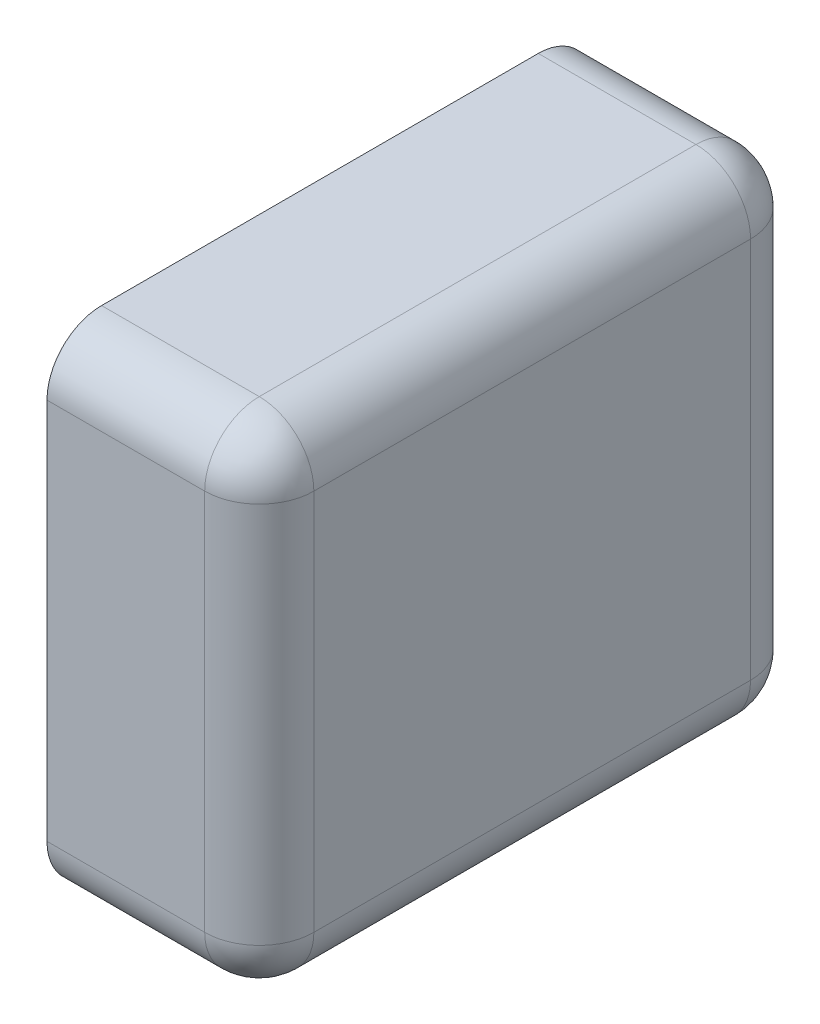
ISO-10303-21;
HEADER;
FILE_DESCRIPTION(('STEP AP214'),'2;1');
FILE_NAME('part.step','',(''),(''),'','','');
FILE_SCHEMA(('AUTOMOTIVE_DESIGN { 1 0 10303 214 1 1 1 1 }'));
ENDSEC;
DATA;
#1=APPLICATION_CONTEXT('core data for automotive mechanical design processes');
#2=APPLICATION_PROTOCOL_DEFINITION('international standard','automotive_design',2000,#1);
#3=PRODUCT_CONTEXT('',#1,'mechanical');
#4=PRODUCT('Part','Part','',(#3));
#5=PRODUCT_RELATED_PRODUCT_CATEGORY('part','',(#4));
#6=PRODUCT_DEFINITION_FORMATION('','',#4);
#7=PRODUCT_DEFINITION_CONTEXT('part definition',#1,'design');
#8=PRODUCT_DEFINITION('design','',#6,#7);
#9=PRODUCT_DEFINITION_SHAPE('','',#8);
#10=(LENGTH_UNIT() NAMED_UNIT(*) SI_UNIT(.MILLI.,.METRE.));
#11=(NAMED_UNIT(*) PLANE_ANGLE_UNIT() SI_UNIT($,.RADIAN.));
#12=(NAMED_UNIT(*) SI_UNIT($,.STERADIAN.) SOLID_ANGLE_UNIT());
#13=UNCERTAINTY_MEASURE_WITH_UNIT(LENGTH_MEASURE(1.E-05),#10,'distance_accuracy_value','');
#14=(GEOMETRIC_REPRESENTATION_CONTEXT(3) GLOBAL_UNCERTAINTY_ASSIGNED_CONTEXT((#13)) GLOBAL_UNIT_ASSIGNED_CONTEXT((#10,
#11,#12)) REPRESENTATION_CONTEXT('',''));
#15=CARTESIAN_POINT('',(0.,0.,0.));
#16=DIRECTION('',(0.,0.,1.));
#17=DIRECTION('',(1.,0.,0.));
#18=AXIS2_PLACEMENT_3D('',#15,#16,#17);
#19=CARTESIAN_POINT('',(0.45,-0.405,0.));
#20=DIRECTION('',(1.,0.,0.));
#21=DIRECTION('',(0.,0.,1.));
#22=AXIS2_PLACEMENT_3D('',#19,#20,#21);
#23=PLANE('',#22);
#24=CARTESIAN_POINT('',(0.45,-0.315,0.81));
#25=DIRECTION('',(-1.,0.,0.));
#26=DIRECTION('',(0.,0.,1.));
#27=AXIS2_PLACEMENT_3D('',#24,#25,#26);
#28=CIRCLE('',#27,0.09);
#29=CARTESIAN_POINT('',(0.45,-0.405,0.81));
#30=VERTEX_POINT('',#29);
#31=CARTESIAN_POINT('',(0.45,-0.315,0.9));
#32=VERTEX_POINT('',#31);
#33=EDGE_CURVE('E11',#30,#32,#28,.T.);
#34=ORIENTED_EDGE('',*,*,#33,.T.);
#35=DIRECTION('',(0.,1.,0.));
#36=VECTOR('',#35,1.);
#37=CARTESIAN_POINT('',(0.45,-0.405,0.9));
#38=LINE('',#37,#36);
#39=CARTESIAN_POINT('',(0.45,0.315,0.9));
#40=VERTEX_POINT('',#39);
#41=EDGE_CURVE('E24',#32,#40,#38,.T.);
#42=ORIENTED_EDGE('',*,*,#41,.T.);
#43=CARTESIAN_POINT('',(0.45,0.315,0.81));
#44=DIRECTION('',(1.,0.,0.));
#45=DIRECTION('',(0.,0.,1.));
#46=AXIS2_PLACEMENT_3D('',#43,#44,#45);
#47=CIRCLE('',#46,0.09);
#48=CARTESIAN_POINT('',(0.45,0.405,0.81));
#49=VERTEX_POINT('',#48);
#50=EDGE_CURVE('E195',#49,#40,#47,.T.);
#51=ORIENTED_EDGE('',*,*,#50,.F.);
#52=DIRECTION('',(0.,0.,1.));
#53=VECTOR('',#52,1.);
#54=CARTESIAN_POINT('',(0.45,0.405,0.));
#55=LINE('',#54,#53);
#56=CARTESIAN_POINT('',(0.45,0.405,0.09));
#57=VERTEX_POINT('',#56);
#58=EDGE_CURVE('E193',#57,#49,#55,.T.);
#59=ORIENTED_EDGE('',*,*,#58,.F.);
#60=CARTESIAN_POINT('',(0.45,0.315,0.09));
#61=DIRECTION('',(-1.,0.,0.));
#62=DIRECTION('',(0.,0.,1.));
#63=AXIS2_PLACEMENT_3D('',#60,#61,#62);
#64=CIRCLE('',#63,0.09);
#65=CARTESIAN_POINT('',(0.45,0.315,0.));
#66=VERTEX_POINT('',#65);
#67=EDGE_CURVE('E190',#57,#66,#64,.T.);
#68=ORIENTED_EDGE('',*,*,#67,.T.);
#69=DIRECTION('',(0.,1.,0.));
#70=VECTOR('',#69,1.);
#71=CARTESIAN_POINT('',(0.45,-0.405,0.));
#72=LINE('',#71,#70);
#73=CARTESIAN_POINT('',(0.45,-0.315,0.));
#74=VERTEX_POINT('',#73);
#75=EDGE_CURVE('E188',#74,#66,#72,.T.);
#76=ORIENTED_EDGE('',*,*,#75,.F.);
#77=CARTESIAN_POINT('',(0.45,-0.315,0.09));
#78=DIRECTION('',(1.,0.,0.));
#79=DIRECTION('',(0.,0.,1.));
#80=AXIS2_PLACEMENT_3D('',#77,#78,#79);
#81=CIRCLE('',#80,0.09);
#82=CARTESIAN_POINT('',(0.45,-0.405,0.09));
#83=VERTEX_POINT('',#82);
#84=EDGE_CURVE('E186',#83,#74,#81,.T.);
#85=ORIENTED_EDGE('',*,*,#84,.F.);
#86=DIRECTION('',(0.,0.,1.));
#87=VECTOR('',#86,1.);
#88=CARTESIAN_POINT('',(0.45,-0.405,0.));
#89=LINE('',#88,#87);
#90=EDGE_CURVE('E36',#83,#30,#89,.T.);
#91=ORIENTED_EDGE('',*,*,#90,.T.);
#92=EDGE_LOOP('',(#34,#42,#51,#59,#68,#76,#85,#91));
#93=FACE_BOUND('',#92,.T.);
#94=ADVANCED_FACE('F17',(#93),#23,.F.);
#95=CARTESIAN_POINT('',(0.45,-0.405,0.));
#96=DIRECTION('',(0.,1.,0.));
#97=DIRECTION('',(0.,0.,1.));
#98=AXIS2_PLACEMENT_3D('',#95,#96,#97);
#99=PLANE('',#98);
#100=DIRECTION('',(1.,0.,0.));
#101=VECTOR('',#100,1.);
#102=CARTESIAN_POINT('',(0.45,-0.405,0.09));
#103=LINE('',#102,#101);
#104=CARTESIAN_POINT('',(0.71,-0.405,0.09));
#105=VERTEX_POINT('',#104);
#106=EDGE_CURVE('E182',#83,#105,#103,.T.);
#107=ORIENTED_EDGE('',*,*,#106,.T.);
#108=DIRECTION('',(0.,0.,1.));
#109=VECTOR('',#108,1.);
#110=CARTESIAN_POINT('',(0.71,-0.405,0.));
#111=LINE('',#110,#109);
#112=CARTESIAN_POINT('',(0.71,-0.405,0.81));
#113=VERTEX_POINT('',#112);
#114=EDGE_CURVE('E179',#105,#113,#111,.T.);
#115=ORIENTED_EDGE('',*,*,#114,.T.);
#116=DIRECTION('',(1.,0.,0.));
#117=VECTOR('',#116,1.);
#118=CARTESIAN_POINT('',(0.45,-0.405,0.81));
#119=LINE('',#118,#117);
#120=EDGE_CURVE('E177',#30,#113,#119,.T.);
#121=ORIENTED_EDGE('',*,*,#120,.F.);
#122=ORIENTED_EDGE('',*,*,#90,.F.);
#123=EDGE_LOOP('',(#107,#115,#121,#122));
#124=FACE_BOUND('',#123,.T.);
#125=ADVANCED_FACE('F227',(#124),#99,.F.);
#126=CARTESIAN_POINT('',(0.45,-0.315,0.09));
#127=DIRECTION('',(1.,0.,0.));
#128=DIRECTION('',(0.,-1.,0.));
#129=AXIS2_PLACEMENT_3D('',#126,#127,#128);
#130=CYLINDRICAL_SURFACE('',#129,0.09);
#131=ORIENTED_EDGE('',*,*,#84,.T.);
#132=DIRECTION('',(1.,0.,0.));
#133=VECTOR('',#132,1.);
#134=CARTESIAN_POINT('',(0.45,-0.315,0.));
#135=LINE('',#134,#133);
#136=CARTESIAN_POINT('',(0.71,-0.315,0.));
#137=VERTEX_POINT('',#136);
#138=EDGE_CURVE('E175',#74,#137,#135,.T.);
#139=ORIENTED_EDGE('',*,*,#138,.T.);
#140=CARTESIAN_POINT('',(0.71,-0.315,0.09));
#141=DIRECTION('',(-1.,0.,0.));
#142=DIRECTION('',(0.,-1.,0.));
#143=AXIS2_PLACEMENT_3D('',#140,#141,#142);
#144=CIRCLE('',#143,0.09);
#145=EDGE_CURVE('E172',#137,#105,#144,.T.);
#146=ORIENTED_EDGE('',*,*,#145,.T.);
#147=ORIENTED_EDGE('',*,*,#106,.F.);
#148=EDGE_LOOP('',(#131,#139,#146,#147));
#149=FACE_BOUND('',#148,.T.);
#150=ADVANCED_FACE('F219',(#149),#130,.T.);
#151=CARTESIAN_POINT('',(0.45,-0.315,0.81));
#152=DIRECTION('',(1.,0.,0.));
#153=DIRECTION('',(0.,-1.,0.));
#154=AXIS2_PLACEMENT_3D('',#151,#152,#153);
#155=CYLINDRICAL_SURFACE('',#154,0.09);
#156=ORIENTED_EDGE('',*,*,#120,.T.);
#157=CARTESIAN_POINT('',(0.71,-0.315,0.81));
#158=DIRECTION('',(1.,0.,0.));
#159=DIRECTION('',(0.,-1.,0.));
#160=AXIS2_PLACEMENT_3D('',#157,#158,#159);
#161=CIRCLE('',#160,0.09);
#162=CARTESIAN_POINT('',(0.71,-0.315,0.9));
#163=VERTEX_POINT('',#162);
#164=EDGE_CURVE('E169',#163,#113,#161,.T.);
#165=ORIENTED_EDGE('',*,*,#164,.F.);
#166=DIRECTION('',(1.,0.,0.));
#167=VECTOR('',#166,1.);
#168=CARTESIAN_POINT('',(0.45,-0.315,0.9));
#169=LINE('',#168,#167);
#170=EDGE_CURVE('E167',#32,#163,#169,.T.);
#171=ORIENTED_EDGE('',*,*,#170,.F.);
#172=ORIENTED_EDGE('',*,*,#33,.F.);
#173=EDGE_LOOP('',(#156,#165,#171,#172));
#174=FACE_BOUND('',#173,.T.);
#175=ADVANCED_FACE('F229',(#174),#155,.T.);
#176=CARTESIAN_POINT('',(0.45,-0.405,0.));
#177=DIRECTION('',(0.,0.,1.));
#178=DIRECTION('',(1.,0.,0.));
#179=AXIS2_PLACEMENT_3D('',#176,#177,#178);
#180=PLANE('',#179);
#181=DIRECTION('',(1.,0.,0.));
#182=VECTOR('',#181,1.);
#183=CARTESIAN_POINT('',(0.45,0.315,0.));
#184=LINE('',#183,#182);
#185=CARTESIAN_POINT('',(0.71,0.315,0.));
#186=VERTEX_POINT('',#185);
#187=EDGE_CURVE('E164',#66,#186,#184,.T.);
#188=ORIENTED_EDGE('',*,*,#187,.T.);
#189=DIRECTION('',(0.,1.,0.));
#190=VECTOR('',#189,1.);
#191=CARTESIAN_POINT('',(0.71,-0.405,0.));
#192=LINE('',#191,#190);
#193=EDGE_CURVE('E162',#137,#186,#192,.T.);
#194=ORIENTED_EDGE('',*,*,#193,.F.);
#195=ORIENTED_EDGE('',*,*,#138,.F.);
#196=ORIENTED_EDGE('',*,*,#75,.T.);
#197=EDGE_LOOP('',(#188,#194,#195,#196));
#198=FACE_BOUND('',#197,.T.);
#199=ADVANCED_FACE('F215',(#198),#180,.F.);
#200=CARTESIAN_POINT('',(0.45,-0.405,0.9));
#201=DIRECTION('',(0.,0.,1.));
#202=DIRECTION('',(1.,0.,0.));
#203=AXIS2_PLACEMENT_3D('',#200,#201,#202);
#204=PLANE('',#203);
#205=ORIENTED_EDGE('',*,*,#41,.F.);
#206=ORIENTED_EDGE('',*,*,#170,.T.);
#207=DIRECTION('',(0.,1.,0.));
#208=VECTOR('',#207,1.);
#209=CARTESIAN_POINT('',(0.71,-0.405,0.9));
#210=LINE('',#209,#208);
#211=CARTESIAN_POINT('',(0.71,0.315,0.9));
#212=VERTEX_POINT('',#211);
#213=EDGE_CURVE('E160',#163,#212,#210,.T.);
#214=ORIENTED_EDGE('',*,*,#213,.T.);
#215=DIRECTION('',(1.,0.,0.));
#216=VECTOR('',#215,1.);
#217=CARTESIAN_POINT('',(0.45,0.315,0.9));
#218=LINE('',#217,#216);
#219=EDGE_CURVE('E157',#40,#212,#218,.T.);
#220=ORIENTED_EDGE('',*,*,#219,.F.);
#221=EDGE_LOOP('',(#205,#206,#214,#220));
#222=FACE_BOUND('',#221,.T.);
#223=ADVANCED_FACE('F200',(#222),#204,.T.);
#224=CARTESIAN_POINT('',(0.45,0.315,0.09));
#225=DIRECTION('',(1.,0.,0.));
#226=DIRECTION('',(0.,1.,0.));
#227=AXIS2_PLACEMENT_3D('',#224,#225,#226);
#228=CYLINDRICAL_SURFACE('',#227,0.09);
#229=DIRECTION('',(1.,0.,0.));
#230=VECTOR('',#229,1.);
#231=CARTESIAN_POINT('',(0.45,0.405,0.09));
#232=LINE('',#231,#230);
#233=CARTESIAN_POINT('',(0.71,0.405,0.09));
#234=VERTEX_POINT('',#233);
#235=EDGE_CURVE('E155',#57,#234,#232,.T.);
#236=ORIENTED_EDGE('',*,*,#235,.T.);
#237=CARTESIAN_POINT('',(0.71,0.315,0.09));
#238=DIRECTION('',(1.,0.,0.));
#239=DIRECTION('',(0.,1.,0.));
#240=AXIS2_PLACEMENT_3D('',#237,#238,#239);
#241=CIRCLE('',#240,0.09);
#242=EDGE_CURVE('E152',#186,#234,#241,.T.);
#243=ORIENTED_EDGE('',*,*,#242,.F.);
#244=ORIENTED_EDGE('',*,*,#187,.F.);
#245=ORIENTED_EDGE('',*,*,#67,.F.);
#246=EDGE_LOOP('',(#236,#243,#244,#245));
#247=FACE_BOUND('',#246,.T.);
#248=ADVANCED_FACE('F211',(#247),#228,.T.);
#249=CARTESIAN_POINT('',(0.45,0.315,0.81));
#250=DIRECTION('',(1.,0.,0.));
#251=DIRECTION('',(0.,1.,0.));
#252=AXIS2_PLACEMENT_3D('',#249,#250,#251);
#253=CYLINDRICAL_SURFACE('',#252,0.09);
#254=ORIENTED_EDGE('',*,*,#50,.T.);
#255=ORIENTED_EDGE('',*,*,#219,.T.);
#256=CARTESIAN_POINT('',(0.71,0.315,0.81));
#257=DIRECTION('',(1.,0.,0.));
#258=DIRECTION('',(0.,0.,1.));
#259=AXIS2_PLACEMENT_3D('',#256,#257,#258);
#260=CIRCLE('',#259,0.09);
#261=CARTESIAN_POINT('',(0.71,0.405,0.81));
#262=VERTEX_POINT('',#261);
#263=EDGE_CURVE('E112',#262,#212,#260,.T.);
#264=ORIENTED_EDGE('',*,*,#263,.F.);
#265=DIRECTION('',(1.,0.,0.));
#266=VECTOR('',#265,1.);
#267=CARTESIAN_POINT('',(0.45,0.405,0.81));
#268=LINE('',#267,#266);
#269=EDGE_CURVE('E148',#49,#262,#268,.T.);
#270=ORIENTED_EDGE('',*,*,#269,.F.);
#271=EDGE_LOOP('',(#254,#255,#264,#270));
#272=FACE_BOUND('',#271,.T.);
#273=ADVANCED_FACE('F202',(#272),#253,.T.);
#274=CARTESIAN_POINT('',(0.45,0.405,0.));
#275=DIRECTION('',(0.,1.,0.));
#276=DIRECTION('',(0.,0.,1.));
#277=AXIS2_PLACEMENT_3D('',#274,#275,#276);
#278=PLANE('',#277);
#279=ORIENTED_EDGE('',*,*,#58,.T.);
#280=ORIENTED_EDGE('',*,*,#269,.T.);
#281=DIRECTION('',(0.,0.,1.));
#282=VECTOR('',#281,1.);
#283=CARTESIAN_POINT('',(0.71,0.405,0.));
#284=LINE('',#283,#282);
#285=EDGE_CURVE('E122',#234,#262,#284,.T.);
#286=ORIENTED_EDGE('',*,*,#285,.F.);
#287=ORIENTED_EDGE('',*,*,#235,.F.);
#288=EDGE_LOOP('',(#279,#280,#286,#287));
#289=FACE_BOUND('',#288,.T.);
#290=ADVANCED_FACE('F204',(#289),#278,.T.);
#291=CARTESIAN_POINT('',(0.71,-0.315,0.));
#292=DIRECTION('',(0.,0.,1.));
#293=DIRECTION('',(1.,0.,0.));
#294=AXIS2_PLACEMENT_3D('',#291,#292,#293);
#295=CYLINDRICAL_SURFACE('',#294,0.09);
#296=CARTESIAN_POINT('',(0.71,-0.315,0.81));
#297=DIRECTION('',(0.,0.,-1.));
#298=DIRECTION('',(1.,0.,0.));
#299=AXIS2_PLACEMENT_3D('',#296,#297,#298);
#300=CIRCLE('',#299,0.09);
#301=CARTESIAN_POINT('',(0.8,-0.315,0.81));
#302=VERTEX_POINT('',#301);
#303=EDGE_CURVE('E144',#302,#113,#300,.T.);
#304=ORIENTED_EDGE('',*,*,#303,.T.);
#305=ORIENTED_EDGE('',*,*,#114,.F.);
#306=CARTESIAN_POINT('',(0.71,-0.315,0.09));
#307=DIRECTION('',(0.,0.,-1.));
#308=DIRECTION('',(1.,0.,0.));
#309=AXIS2_PLACEMENT_3D('',#306,#307,#308);
#310=CIRCLE('',#309,0.09);
#311=CARTESIAN_POINT('',(0.8,-0.315,0.09));
#312=VERTEX_POINT('',#311);
#313=EDGE_CURVE('E141',#312,#105,#310,.T.);
#314=ORIENTED_EDGE('',*,*,#313,.F.);
#315=DIRECTION('',(0.,0.,1.));
#316=VECTOR('',#315,1.);
#317=CARTESIAN_POINT('',(0.8,-0.315,0.));
#318=LINE('',#317,#316);
#319=EDGE_CURVE('E138',#312,#302,#318,.T.);
#320=ORIENTED_EDGE('',*,*,#319,.T.);
#321=EDGE_LOOP('',(#304,#305,#314,#320));
#322=FACE_BOUND('',#321,.T.);
#323=ADVANCED_FACE('F224',(#322),#295,.T.);
#324=CARTESIAN_POINT('',(0.71,-0.315,0.09));
#325=DIRECTION('',(0.,0.,1.));
#326=DIRECTION('',(1.,0.,0.));
#327=AXIS2_PLACEMENT_3D('',#324,#325,#326);
#328=SPHERICAL_SURFACE('',#327,0.09);
#329=ORIENTED_EDGE('',*,*,#313,.T.);
#330=ORIENTED_EDGE('',*,*,#145,.F.);
#331=CARTESIAN_POINT('',(0.71,-0.315,0.09));
#332=DIRECTION('',(0.,-1.,0.));
#333=DIRECTION('',(1.,0.,0.));
#334=AXIS2_PLACEMENT_3D('',#331,#332,#333);
#335=CIRCLE('',#334,0.09);
#336=EDGE_CURVE('E135',#137,#312,#335,.T.);
#337=ORIENTED_EDGE('',*,*,#336,.T.);
#338=EDGE_LOOP('',(#329,#330,#337));
#339=FACE_BOUND('',#338,.T.);
#340=ADVANCED_FACE('F222',(#339),#328,.T.);
#341=CARTESIAN_POINT('',(0.71,-0.315,0.81));
#342=DIRECTION('',(0.,0.,-1.));
#343=DIRECTION('',(1.,0.,0.));
#344=AXIS2_PLACEMENT_3D('',#341,#342,#343);
#345=SPHERICAL_SURFACE('',#344,0.09);
#346=CARTESIAN_POINT('',(0.71,-0.315,0.81));
#347=DIRECTION('',(0.,1.,0.));
#348=DIRECTION('',(1.,0.,0.));
#349=AXIS2_PLACEMENT_3D('',#346,#347,#348);
#350=CIRCLE('',#349,0.09);
#351=EDGE_CURVE('E100',#163,#302,#350,.T.);
#352=ORIENTED_EDGE('',*,*,#351,.F.);
#353=ORIENTED_EDGE('',*,*,#164,.T.);
#354=ORIENTED_EDGE('',*,*,#303,.F.);
#355=EDGE_LOOP('',(#352,#353,#354));
#356=FACE_BOUND('',#355,.T.);
#357=ADVANCED_FACE('F231',(#356),#345,.T.);
#358=CARTESIAN_POINT('',(0.71,-0.405,0.09));
#359=DIRECTION('',(0.,1.,0.));
#360=DIRECTION('',(1.,0.,0.));
#361=AXIS2_PLACEMENT_3D('',#358,#359,#360);
#362=CYLINDRICAL_SURFACE('',#361,0.09);
#363=ORIENTED_EDGE('',*,*,#336,.F.);
#364=ORIENTED_EDGE('',*,*,#193,.T.);
#365=CARTESIAN_POINT('',(0.71,0.315,0.09));
#366=DIRECTION('',(0.,-1.,0.));
#367=DIRECTION('',(1.,0.,0.));
#368=AXIS2_PLACEMENT_3D('',#365,#366,#367);
#369=CIRCLE('',#368,0.09);
#370=CARTESIAN_POINT('',(0.8,0.315,0.09));
#371=VERTEX_POINT('',#370);
#372=EDGE_CURVE('E132',#186,#371,#369,.T.);
#373=ORIENTED_EDGE('',*,*,#372,.T.);
#374=DIRECTION('',(0.,1.,0.));
#375=VECTOR('',#374,1.);
#376=CARTESIAN_POINT('',(0.8,-0.405,0.09));
#377=LINE('',#376,#375);
#378=EDGE_CURVE('E104',#312,#371,#377,.T.);
#379=ORIENTED_EDGE('',*,*,#378,.F.);
#380=EDGE_LOOP('',(#363,#364,#373,#379));
#381=FACE_BOUND('',#380,.T.);
#382=ADVANCED_FACE('F233',(#381),#362,.T.);
#383=CARTESIAN_POINT('',(0.71,-0.405,0.81));
#384=DIRECTION('',(0.,1.,0.));
#385=DIRECTION('',(1.,0.,0.));
#386=AXIS2_PLACEMENT_3D('',#383,#384,#385);
#387=CYLINDRICAL_SURFACE('',#386,0.09);
#388=DIRECTION('',(0.,1.,0.));
#389=VECTOR('',#388,1.);
#390=CARTESIAN_POINT('',(0.8,-0.405,0.81));
#391=LINE('',#390,#389);
#392=CARTESIAN_POINT('',(0.8,0.315,0.81));
#393=VERTEX_POINT('',#392);
#394=EDGE_CURVE('E94',#302,#393,#391,.T.);
#395=ORIENTED_EDGE('',*,*,#394,.T.);
#396=CARTESIAN_POINT('',(0.71,0.315,0.81));
#397=DIRECTION('',(0.,-1.,0.));
#398=DIRECTION('',(1.,0.,0.));
#399=AXIS2_PLACEMENT_3D('',#396,#397,#398);
#400=CIRCLE('',#399,0.09);
#401=EDGE_CURVE('E98',#393,#212,#400,.T.);
#402=ORIENTED_EDGE('',*,*,#401,.T.);
#403=ORIENTED_EDGE('',*,*,#213,.F.);
#404=ORIENTED_EDGE('',*,*,#351,.T.);
#405=EDGE_LOOP('',(#395,#402,#403,#404));
#406=FACE_BOUND('',#405,.T.);
#407=ADVANCED_FACE('F96',(#406),#387,.T.);
#408=CARTESIAN_POINT('',(0.71,0.315,0.09));
#409=DIRECTION('',(0.,0.,1.));
#410=DIRECTION('',(1.,0.,0.));
#411=AXIS2_PLACEMENT_3D('',#408,#409,#410);
#412=SPHERICAL_SURFACE('',#411,0.09);
#413=ORIENTED_EDGE('',*,*,#372,.F.);
#414=ORIENTED_EDGE('',*,*,#242,.T.);
#415=CARTESIAN_POINT('',(0.71,0.315,0.09));
#416=DIRECTION('',(0.,0.,1.));
#417=DIRECTION('',(1.,0.,0.));
#418=AXIS2_PLACEMENT_3D('',#415,#416,#417);
#419=CIRCLE('',#418,0.09);
#420=EDGE_CURVE('E113',#371,#234,#419,.T.);
#421=ORIENTED_EDGE('',*,*,#420,.F.);
#422=EDGE_LOOP('',(#413,#414,#421));
#423=FACE_BOUND('',#422,.T.);
#424=ADVANCED_FACE('F300',(#423),#412,.T.);
#425=CARTESIAN_POINT('',(0.71,0.315,0.81));
#426=DIRECTION('',(0.,-1.,0.));
#427=DIRECTION('',(1.,0.,0.));
#428=AXIS2_PLACEMENT_3D('',#425,#426,#427);
#429=SPHERICAL_SURFACE('',#428,0.09);
#430=CARTESIAN_POINT('',(0.71,0.315,0.81));
#431=DIRECTION('',(0.,0.,-1.));
#432=DIRECTION('',(1.,0.,0.));
#433=AXIS2_PLACEMENT_3D('',#430,#431,#432);
#434=CIRCLE('',#433,0.09);
#435=EDGE_CURVE('E111',#262,#393,#434,.T.);
#436=ORIENTED_EDGE('',*,*,#435,.F.);
#437=ORIENTED_EDGE('',*,*,#263,.T.);
#438=ORIENTED_EDGE('',*,*,#401,.F.);
#439=EDGE_LOOP('',(#436,#437,#438));
#440=FACE_BOUND('',#439,.T.);
#441=ADVANCED_FACE('F110',(#440),#429,.T.);
#442=CARTESIAN_POINT('',(0.71,0.315,0.));
#443=DIRECTION('',(0.,0.,1.));
#444=DIRECTION('',(1.,0.,0.));
#445=AXIS2_PLACEMENT_3D('',#442,#443,#444);
#446=CYLINDRICAL_SURFACE('',#445,0.09);
#447=DIRECTION('',(0.,0.,1.));
#448=VECTOR('',#447,1.);
#449=CARTESIAN_POINT('',(0.8,0.315,0.));
#450=LINE('',#449,#448);
#451=EDGE_CURVE('E120',#371,#393,#450,.T.);
#452=ORIENTED_EDGE('',*,*,#451,.F.);
#453=ORIENTED_EDGE('',*,*,#420,.T.);
#454=ORIENTED_EDGE('',*,*,#285,.T.);
#455=ORIENTED_EDGE('',*,*,#435,.T.);
#456=EDGE_LOOP('',(#452,#453,#454,#455));
#457=FACE_BOUND('',#456,.T.);
#458=ADVANCED_FACE('F118',(#457),#446,.T.);
#459=CARTESIAN_POINT('',(0.8,-0.405,0.));
#460=DIRECTION('',(1.,0.,0.));
#461=DIRECTION('',(0.,0.,1.));
#462=AXIS2_PLACEMENT_3D('',#459,#460,#461);
#463=PLANE('',#462);
#464=ORIENTED_EDGE('',*,*,#319,.F.);
#465=ORIENTED_EDGE('',*,*,#378,.T.);
#466=ORIENTED_EDGE('',*,*,#451,.T.);
#467=ORIENTED_EDGE('',*,*,#394,.F.);
#468=EDGE_LOOP('',(#464,#465,#466,#467));
#469=FACE_BOUND('',#468,.T.);
#470=ADVANCED_FACE('F125',(#469),#463,.T.);
#471=CLOSED_SHELL('',(#94,#125,#150,#175,#199,#223,#248,#273,#290,#323,#340,#357,#382,#407,#424,
#441,#458,#470));
#472=MANIFOLD_SOLID_BREP('B1',#471);
#473=ADVANCED_BREP_SHAPE_REPRESENTATION('',(#18,#472),#14);
#474=SHAPE_DEFINITION_REPRESENTATION(#9,#473);
ENDSEC;
END-ISO-10303-21;
